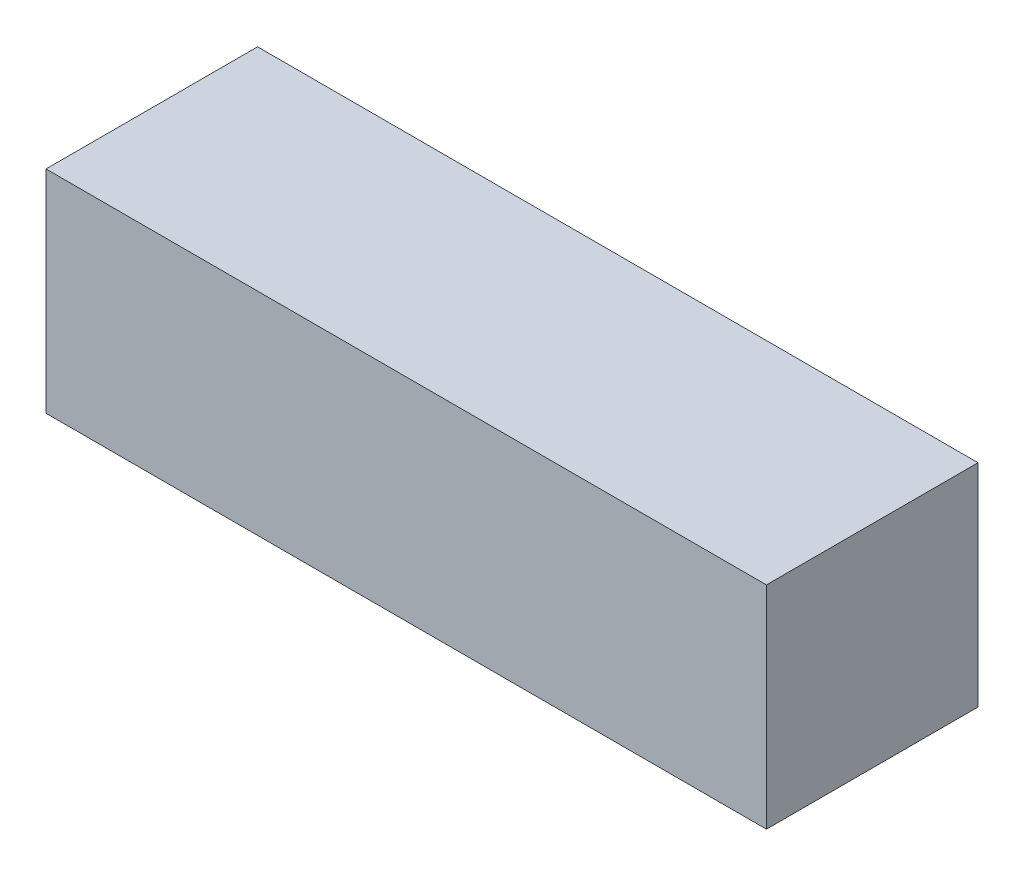
ISO-10303-21;
HEADER;
FILE_DESCRIPTION(('STEP AP214'),'2;1');
FILE_NAME('part.step','',(''),(''),'','','');
FILE_SCHEMA(('AUTOMOTIVE_DESIGN { 1 0 10303 214 1 1 1 1 }'));
ENDSEC;
DATA;
#1=APPLICATION_CONTEXT('core data for automotive mechanical design processes');
#2=APPLICATION_PROTOCOL_DEFINITION('international standard','automotive_design',2000,#1);
#3=PRODUCT_CONTEXT('',#1,'mechanical');
#4=PRODUCT('Part','Part','',(#3));
#5=PRODUCT_RELATED_PRODUCT_CATEGORY('part','',(#4));
#6=PRODUCT_DEFINITION_FORMATION('','',#4);
#7=PRODUCT_DEFINITION_CONTEXT('part definition',#1,'design');
#8=PRODUCT_DEFINITION('design','',#6,#7);
#9=PRODUCT_DEFINITION_SHAPE('','',#8);
#10=(LENGTH_UNIT() NAMED_UNIT(*) SI_UNIT(.MILLI.,.METRE.));
#11=(NAMED_UNIT(*) PLANE_ANGLE_UNIT() SI_UNIT($,.RADIAN.));
#12=(NAMED_UNIT(*) SI_UNIT($,.STERADIAN.) SOLID_ANGLE_UNIT());
#13=UNCERTAINTY_MEASURE_WITH_UNIT(LENGTH_MEASURE(1.E-05),#10,'distance_accuracy_value','');
#14=(GEOMETRIC_REPRESENTATION_CONTEXT(3) GLOBAL_UNCERTAINTY_ASSIGNED_CONTEXT((#13)) GLOBAL_UNIT_ASSIGNED_CONTEXT((#10,
#11,#12)) REPRESENTATION_CONTEXT('',''));
#15=CARTESIAN_POINT('',(0.,0.,0.));
#16=DIRECTION('',(0.,0.,1.));
#17=DIRECTION('',(1.,0.,0.));
#18=AXIS2_PLACEMENT_3D('',#15,#16,#17);
#19=CARTESIAN_POINT('',(170.25,100.,50.));
#20=DIRECTION('',(-1.,0.,0.));
#21=DIRECTION('',(0.,0.,1.));
#22=AXIS2_PLACEMENT_3D('',#19,#20,#21);
#23=PLANE('',#22);
#24=DIRECTION('',(0.,0.,-1.));
#25=VECTOR('',#24,1.);
#26=CARTESIAN_POINT('',(170.25,0.,50.));
#27=LINE('',#26,#25);
#28=CARTESIAN_POINT('',(170.25,0.,50.));
#29=VERTEX_POINT('',#28);
#30=CARTESIAN_POINT('',(170.25,0.,-50.));
#31=VERTEX_POINT('',#30);
#32=EDGE_CURVE('E95',#29,#31,#27,.T.);
#33=ORIENTED_EDGE('',*,*,#32,.T.);
#34=DIRECTION('',(0.,-1.,0.));
#35=VECTOR('',#34,1.);
#36=CARTESIAN_POINT('',(170.25,100.,-50.));
#37=LINE('',#36,#35);
#38=CARTESIAN_POINT('',(170.25,100.,-50.));
#39=VERTEX_POINT('',#38);
#40=EDGE_CURVE('E11',#39,#31,#37,.T.);
#41=ORIENTED_EDGE('',*,*,#40,.F.);
#42=DIRECTION('',(0.,0.,-1.));
#43=VECTOR('',#42,1.);
#44=CARTESIAN_POINT('',(170.25,100.,50.));
#45=LINE('',#44,#43);
#46=CARTESIAN_POINT('',(170.25,100.,50.));
#47=VERTEX_POINT('',#46);
#48=EDGE_CURVE('E83',#47,#39,#45,.T.);
#49=ORIENTED_EDGE('',*,*,#48,.F.);
#50=DIRECTION('',(0.,-1.,0.));
#51=VECTOR('',#50,1.);
#52=CARTESIAN_POINT('',(170.25,100.,50.));
#53=LINE('',#52,#51);
#54=EDGE_CURVE('E91',#47,#29,#53,.T.);
#55=ORIENTED_EDGE('',*,*,#54,.T.);
#56=EDGE_LOOP('',(#33,#41,#49,#55));
#57=FACE_BOUND('',#56,.T.);
#58=ADVANCED_FACE('F32',(#57),#23,.F.);
#59=CARTESIAN_POINT('',(-170.25,100.,-50.));
#60=DIRECTION('',(0.,0.,1.));
#61=DIRECTION('',(1.,0.,0.));
#62=AXIS2_PLACEMENT_3D('',#59,#60,#61);
#63=PLANE('',#62);
#64=DIRECTION('',(-1.,0.,0.));
#65=VECTOR('',#64,1.);
#66=CARTESIAN_POINT('',(-170.25,0.,-50.));
#67=LINE('',#66,#65);
#68=CARTESIAN_POINT('',(-170.25,0.,-50.));
#69=VERTEX_POINT('',#68);
#70=EDGE_CURVE('E87',#31,#69,#67,.T.);
#71=ORIENTED_EDGE('',*,*,#70,.T.);
#72=DIRECTION('',(0.,-1.,0.));
#73=VECTOR('',#72,1.);
#74=CARTESIAN_POINT('',(-170.25,100.,-50.));
#75=LINE('',#74,#73);
#76=CARTESIAN_POINT('',(-170.25,100.,-50.));
#77=VERTEX_POINT('',#76);
#78=EDGE_CURVE('E40',#77,#69,#75,.T.);
#79=ORIENTED_EDGE('',*,*,#78,.F.);
#80=DIRECTION('',(-1.,0.,0.));
#81=VECTOR('',#80,1.);
#82=CARTESIAN_POINT('',(-170.25,100.,-50.));
#83=LINE('',#82,#81);
#84=EDGE_CURVE('E78',#39,#77,#83,.T.);
#85=ORIENTED_EDGE('',*,*,#84,.F.);
#86=ORIENTED_EDGE('',*,*,#40,.T.);
#87=EDGE_LOOP('',(#71,#79,#85,#86));
#88=FACE_BOUND('',#87,.T.);
#89=ADVANCED_FACE('F86',(#88),#63,.F.);
#90=CARTESIAN_POINT('',(-170.25,100.,50.));
#91=DIRECTION('',(1.,0.,0.));
#92=DIRECTION('',(0.,0.,-1.));
#93=AXIS2_PLACEMENT_3D('',#90,#91,#92);
#94=PLANE('',#93);
#95=DIRECTION('',(0.,0.,1.));
#96=VECTOR('',#95,1.);
#97=CARTESIAN_POINT('',(-170.25,0.,50.));
#98=LINE('',#97,#96);
#99=CARTESIAN_POINT('',(-170.25,0.,50.));
#100=VERTEX_POINT('',#99);
#101=EDGE_CURVE('E65',#69,#100,#98,.T.);
#102=ORIENTED_EDGE('',*,*,#101,.T.);
#103=DIRECTION('',(0.,-1.,0.));
#104=VECTOR('',#103,1.);
#105=CARTESIAN_POINT('',(-170.25,100.,50.));
#106=LINE('',#105,#104);
#107=CARTESIAN_POINT('',(-170.25,100.,50.));
#108=VERTEX_POINT('',#107);
#109=EDGE_CURVE('E88',#108,#100,#106,.T.);
#110=ORIENTED_EDGE('',*,*,#109,.F.);
#111=DIRECTION('',(0.,0.,1.));
#112=VECTOR('',#111,1.);
#113=CARTESIAN_POINT('',(-170.25,100.,50.));
#114=LINE('',#113,#112);
#115=EDGE_CURVE('E81',#77,#108,#114,.T.);
#116=ORIENTED_EDGE('',*,*,#115,.F.);
#117=ORIENTED_EDGE('',*,*,#78,.T.);
#118=EDGE_LOOP('',(#102,#110,#116,#117));
#119=FACE_BOUND('',#118,.T.);
#120=ADVANCED_FACE('F89',(#119),#94,.F.);
#121=CARTESIAN_POINT('',(-170.25,100.,50.));
#122=DIRECTION('',(0.,0.,-1.));
#123=DIRECTION('',(-1.,0.,0.));
#124=AXIS2_PLACEMENT_3D('',#121,#122,#123);
#125=PLANE('',#124);
#126=DIRECTION('',(1.,0.,0.));
#127=VECTOR('',#126,1.);
#128=CARTESIAN_POINT('',(-170.25,0.,50.));
#129=LINE('',#128,#127);
#130=EDGE_CURVE('E71',#100,#29,#129,.T.);
#131=ORIENTED_EDGE('',*,*,#130,.T.);
#132=ORIENTED_EDGE('',*,*,#54,.F.);
#133=DIRECTION('',(1.,0.,0.));
#134=VECTOR('',#133,1.);
#135=CARTESIAN_POINT('',(-170.25,100.,50.));
#136=LINE('',#135,#134);
#137=EDGE_CURVE('E48',#108,#47,#136,.T.);
#138=ORIENTED_EDGE('',*,*,#137,.F.);
#139=ORIENTED_EDGE('',*,*,#109,.T.);
#140=EDGE_LOOP('',(#131,#132,#138,#139));
#141=FACE_BOUND('',#140,.T.);
#142=ADVANCED_FACE('F102',(#141),#125,.F.);
#143=CARTESIAN_POINT('',(0.,100.,0.));
#144=DIRECTION('',(0.,-1.,0.));
#145=DIRECTION('',(0.,0.,-1.));
#146=AXIS2_PLACEMENT_3D('',#143,#144,#145);
#147=PLANE('',#146);
#148=ORIENTED_EDGE('',*,*,#48,.T.);
#149=ORIENTED_EDGE('',*,*,#84,.T.);
#150=ORIENTED_EDGE('',*,*,#115,.T.);
#151=ORIENTED_EDGE('',*,*,#137,.T.);
#152=EDGE_LOOP('',(#148,#149,#150,#151));
#153=FACE_BOUND('',#152,.T.);
#154=ADVANCED_FACE('F79',(#153),#147,.F.);
#155=CARTESIAN_POINT('',(0.,0.,0.));
#156=DIRECTION('',(0.,-1.,0.));
#157=DIRECTION('',(0.,0.,-1.));
#158=AXIS2_PLACEMENT_3D('',#155,#156,#157);
#159=PLANE('',#158);
#160=ORIENTED_EDGE('',*,*,#32,.F.);
#161=ORIENTED_EDGE('',*,*,#130,.F.);
#162=ORIENTED_EDGE('',*,*,#101,.F.);
#163=ORIENTED_EDGE('',*,*,#70,.F.);
#164=EDGE_LOOP('',(#160,#161,#162,#163));
#165=FACE_BOUND('',#164,.T.);
#166=ADVANCED_FACE('F105',(#165),#159,.T.);
#167=CLOSED_SHELL('',(#58,#89,#120,#142,#154,#166));
#168=MANIFOLD_SOLID_BREP('B2',#167);
#169=ADVANCED_BREP_SHAPE_REPRESENTATION('',(#18,#168),#14);
#170=SHAPE_DEFINITION_REPRESENTATION(#9,#169);
ENDSEC;
END-ISO-10303-21;
